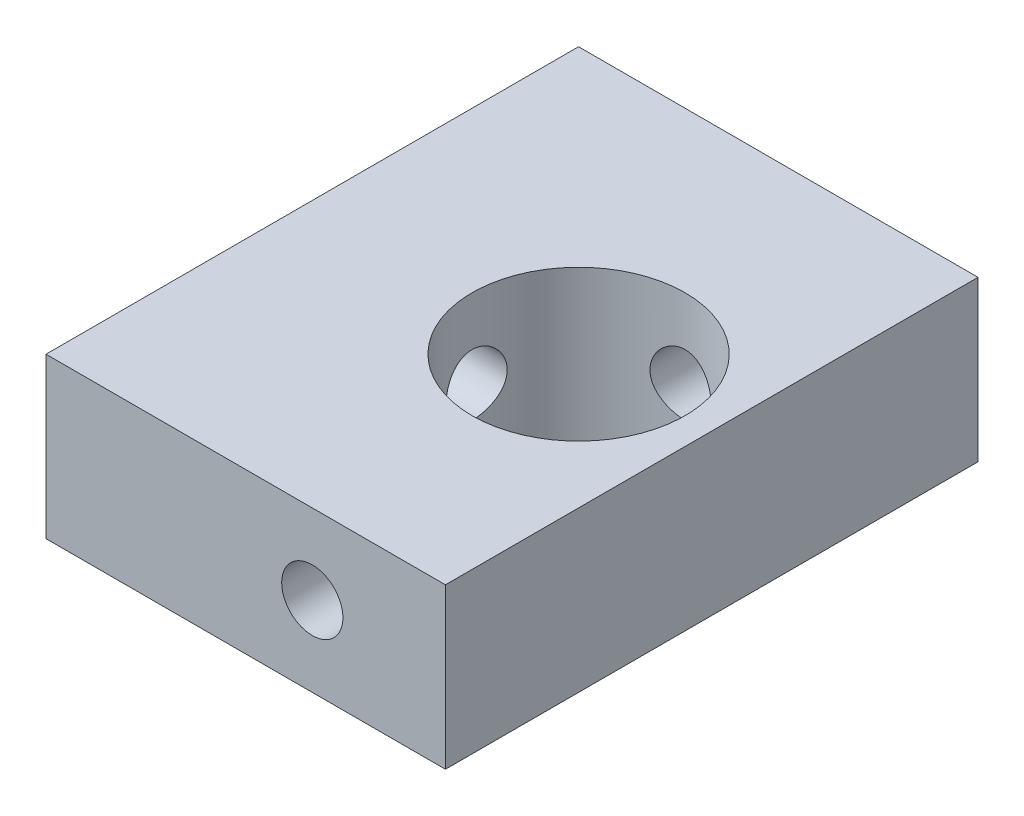
ISO-10303-21;
HEADER;
FILE_DESCRIPTION(('STEP AP214'),'2;1');
FILE_NAME('part.step','',(''),(''),'','','');
FILE_SCHEMA(('AUTOMOTIVE_DESIGN { 1 0 10303 214 1 1 1 1 }'));
ENDSEC;
DATA;
#1=APPLICATION_CONTEXT('core data for automotive mechanical design processes');
#2=APPLICATION_PROTOCOL_DEFINITION('international standard','automotive_design',2000,#1);
#3=PRODUCT_CONTEXT('',#1,'mechanical');
#4=PRODUCT('Part','Part','',(#3));
#5=PRODUCT_RELATED_PRODUCT_CATEGORY('part','',(#4));
#6=PRODUCT_DEFINITION_FORMATION('','',#4);
#7=PRODUCT_DEFINITION_CONTEXT('part definition',#1,'design');
#8=PRODUCT_DEFINITION('design','',#6,#7);
#9=PRODUCT_DEFINITION_SHAPE('','',#8);
#10=(LENGTH_UNIT() NAMED_UNIT(*) SI_UNIT(.MILLI.,.METRE.));
#11=(NAMED_UNIT(*) PLANE_ANGLE_UNIT() SI_UNIT($,.RADIAN.));
#12=(NAMED_UNIT(*) SI_UNIT($,.STERADIAN.) SOLID_ANGLE_UNIT());
#13=UNCERTAINTY_MEASURE_WITH_UNIT(LENGTH_MEASURE(1.E-05),#10,'distance_accuracy_value','');
#14=(GEOMETRIC_REPRESENTATION_CONTEXT(3) GLOBAL_UNCERTAINTY_ASSIGNED_CONTEXT((#13)) GLOBAL_UNIT_ASSIGNED_CONTEXT((#10,
#11,#12)) REPRESENTATION_CONTEXT('',''));
#15=CARTESIAN_POINT('',(0.,0.,0.));
#16=DIRECTION('',(0.,0.,1.));
#17=DIRECTION('',(1.,0.,0.));
#18=AXIS2_PLACEMENT_3D('',#15,#16,#17);
#19=CARTESIAN_POINT('',(10.,3.,20.));
#20=DIRECTION('',(0.,0.,-1.));
#21=DIRECTION('',(-1.,0.,0.));
#22=AXIS2_PLACEMENT_3D('',#19,#20,#21);
#23=CYLINDRICAL_SURFACE('',#22,1.15);
#24=CARTESIAN_POINT('',(8.85,3.,13.8311225508981));
#25=CARTESIAN_POINT('',(8.85000109713594,2.93685354763671,13.8311234096432));
#26=CARTESIAN_POINT('',(8.85521875938077,2.87369604653529,13.8327008482293));
#27=CARTESIAN_POINT('',(8.87590336907801,2.74921880863793,13.8388174631075));
#28=CARTESIAN_POINT('',(8.89137439287323,2.6878998128995,13.8433578173301));
#29=CARTESIAN_POINT('',(8.93200398573888,2.56891896779639,13.8548444617641));
#30=CARTESIAN_POINT('',(8.95714741863079,2.51125156750833,13.8617869911566));
#31=CARTESIAN_POINT('',(9.01635919152072,2.40094121549271,13.8772907666046));
#32=CARTESIAN_POINT('',(9.05042862571803,2.34829888084604,13.8858522110799));
#33=CARTESIAN_POINT('',(9.12758497596414,2.24800305821177,13.9039081457365));
#34=CARTESIAN_POINT('',(9.17088552483237,2.20051723044332,13.9134212557284));
#35=CARTESIAN_POINT('',(9.26481649766861,2.11337131483704,13.93214894899));
#36=CARTESIAN_POINT('',(9.3154477886892,2.07371215402091,13.941363496789));
#37=CARTESIAN_POINT('',(9.42378405058578,2.00262855922055,13.958665902629));
#38=CARTESIAN_POINT('',(9.48160435904936,1.97137342120741,13.9667292515258));
#39=CARTESIAN_POINT('',(9.60195084081706,1.91909370888843,13.9806054546299));
#40=CARTESIAN_POINT('',(9.66447608308574,1.89806711662292,13.9864187526967));
#41=CARTESIAN_POINT('',(9.79070500883242,1.86739145819638,13.9950081423137));
#42=CARTESIAN_POINT('',(9.85433396136122,1.85745658262848,13.9978603903831));
#43=CARTESIAN_POINT('',(9.98241516794994,1.84834439508034,14.0004737583295));
#44=CARTESIAN_POINT('',(10.0468672603199,1.84916500190013,14.0002354762282));
#45=CARTESIAN_POINT('',(10.1727662359451,1.86134497675429,13.9967492302424));
#46=CARTESIAN_POINT('',(10.2342458601377,1.87239512664959,13.9935895768992));
#47=CARTESIAN_POINT('',(10.3544381694963,1.90421756715159,13.9847217177274));
#48=CARTESIAN_POINT('',(10.4131506851542,1.92499045250551,13.9790133559934));
#49=CARTESIAN_POINT('',(10.5268981348963,1.97588861231533,13.9655639569197));
#50=CARTESIAN_POINT('',(10.5818853868973,2.00611447226775,13.9578012031085));
#51=CARTESIAN_POINT('',(10.686108784487,2.07498199129164,13.9410715508783));
#52=CARTESIAN_POINT('',(10.7353436530329,2.11362551367083,13.9321043860233));
#53=CARTESIAN_POINT('',(10.8285106967381,2.19985012239459,13.913554446745));
#54=CARTESIAN_POINT('',(10.8721924098498,2.24769991013597,13.9039611194572));
#55=CARTESIAN_POINT('',(10.9509785745041,2.35014190982722,13.8855220189199));
#56=CARTESIAN_POINT('',(10.9860823118708,2.40473468260804,13.8766763079548));
#57=CARTESIAN_POINT('',(11.0469491955457,2.51972677993943,13.8606864875837));
#58=CARTESIAN_POINT('',(11.0726336618664,2.58016991201733,13.8535568752147));
#59=CARTESIAN_POINT('',(11.1133891241829,2.7047745792295,13.841981078064));
#60=CARTESIAN_POINT('',(11.1284632535755,2.76893501052477,13.8375341011141));
#61=CARTESIAN_POINT('',(11.1471162340068,2.89678504548647,13.8319990048806));
#62=CARTESIAN_POINT('',(11.1510730711851,2.96041477483418,13.8308004903882));
#63=CARTESIAN_POINT('',(11.1484292606137,3.08742899506654,13.8315939820927));
#64=CARTESIAN_POINT('',(11.1418299491375,3.15081351597334,13.8335855844615));
#65=CARTESIAN_POINT('',(11.118596554369,3.27400892985881,13.8404272046237));
#66=CARTESIAN_POINT('',(11.1021995229819,3.33386865703835,13.8452096374164));
#67=CARTESIAN_POINT('',(11.0601077430504,3.44998546694598,13.8570255765461));
#68=CARTESIAN_POINT('',(11.0344116410675,3.50624202384511,13.8640594105474));
#69=CARTESIAN_POINT('',(10.9737148486598,3.61511001116527,13.8798045097428));
#70=CARTESIAN_POINT('',(10.9384975703062,3.66759512627495,13.8885533200723));
#71=CARTESIAN_POINT('',(10.8600196226804,3.76604914872634,13.9066590507113));
#72=CARTESIAN_POINT('',(10.8167571878005,3.81201662178159,13.9160161042134));
#73=CARTESIAN_POINT('',(10.7216509250253,3.89775091777679,13.9346719440207));
#74=CARTESIAN_POINT('',(10.6695639192415,3.93725142123724,13.9439577564339));
#75=CARTESIAN_POINT('',(10.5592834730476,4.00695383710908,13.9610997441538));
#76=CARTESIAN_POINT('',(10.501090350612,4.03715623339531,13.9689559938464));
#77=CARTESIAN_POINT('',(10.3806506157329,4.08711614590499,13.9823038526595));
#78=CARTESIAN_POINT('',(10.3184388507805,4.10695267050574,13.9878132876844));
#79=CARTESIAN_POINT('',(10.1913798256697,4.13583241025023,13.9959254931484));
#80=CARTESIAN_POINT('',(10.1265332572855,4.14487843977111,13.9985290214948));
#81=CARTESIAN_POINT('',(9.99851650441062,4.15172074840701,14.0004939021936));
#82=CARTESIAN_POINT('',(9.93536849385019,4.14990485811465,13.999967031704));
#83=CARTESIAN_POINT('',(9.81031469284554,4.13599167465084,13.995989631422));
#84=CARTESIAN_POINT('',(9.74840884176098,4.12389488463335,13.9925392447084));
#85=CARTESIAN_POINT('',(9.62814263341813,4.08999586262566,13.9831307693267));
#86=CARTESIAN_POINT('',(9.56975501271397,4.0682834691471,13.9771959204306));
#87=CARTESIAN_POINT('',(9.45741937378848,4.0158495223448,13.9634344278209));
#88=CARTESIAN_POINT('',(9.40347205017424,3.98512656289235,13.9556074888739));
#89=CARTESIAN_POINT('',(9.29978977331117,3.9144716965877,13.9385975168749));
#90=CARTESIAN_POINT('',(9.25022991228369,3.87429100539303,13.9293808251979));
#91=CARTESIAN_POINT('',(9.15842587096337,3.78631839616156,13.9107482289939));
#92=CARTESIAN_POINT('',(9.11618372897389,3.7385243645712,13.9013322697791));
#93=CARTESIAN_POINT('',(9.03908743865413,3.63514895353306,13.8830737328542));
#94=CARTESIAN_POINT('',(9.00446060677457,3.57939375471937,13.8742531706148));
#95=CARTESIAN_POINT('',(8.94511649390382,3.46260717564617,13.8585190322725));
#96=CARTESIAN_POINT('',(8.92039376066198,3.40157872089631,13.8516044075984));
#97=CARTESIAN_POINT('',(8.88418491195494,3.284130424163,13.8412580119303));
#98=CARTESIAN_POINT('',(8.87139878025116,3.22813801740635,13.8374910523626));
#99=CARTESIAN_POINT('',(8.8543065153319,3.11476663088778,13.8324231321664));
#100=CARTESIAN_POINT('',(8.84999900291622,3.05738787817743,13.8311217704654));
#101=CARTESIAN_POINT('',(8.85,3.,13.8311225508981));
#102=B_SPLINE_CURVE_WITH_KNOTS('',3,(#24,#25,#26,#27,#28,#29,#30,#31,#32,#33,#34,#35,#36,#37,
#38,#39,#40,#41,#42,#43,#44,#45,#46,#47,#48,#49,#50,#51,#52,#53,#54,#55,#56,#57,#58,#59,#60,#61,
#62,#63,#64,#65,#66,#67,#68,#69,#70,#71,#72,#73,#74,#75,#76,#77,#78,#79,#80,#81,#82,#83,#84,#85,
#86,#87,#88,#89,#90,#91,#92,#93,#94,#95,#96,#97,#98,#99,#100,#101),.UNSPECIFIED.,.T.,.F.,(4,2,2,
2,2,2,2,2,2,2,2,2,2,2,2,2,2,2,2,2,2,2,2,2,2,2,2,2,2,2,2,2,2,2,2,2,2,2,4),(0.,0.189227930907146,
0.378531136737258,0.567539302607267,0.7565706490078,0.95057452796,1.14460137173343,
1.34228521426901,1.53993004050829,1.73235516813842,1.9247430618032,2.11149893393056,
2.29826623155154,2.48709264626916,2.67596090156999,2.87153758994763,3.06713055589602,
3.26432199425326,3.46145517446465,3.65179968398441,3.84212010022938,4.02801232563787,
4.21393161772203,4.40449966366975,4.59510958156286,4.79224838850887,4.98937693458781,
5.18498021232715,5.38053246165302,5.56914510017873,5.75774850841006,5.94462579753225,
6.13153226500683,6.32405015408942,6.51662158186276,6.71433352890712,6.91193648457659,
7.08393595483978,7.25590744397728),.UNSPECIFIED.);
#103=CARTESIAN_POINT('',(8.85,3.,13.8311225508981));
#104=VERTEX_POINT('',#103);
#105=EDGE_CURVE('E36',#104,#104,#102,.T.);
#106=ORIENTED_EDGE('',*,*,#105,.F.);
#107=EDGE_LOOP('',(#106));
#108=FACE_BOUND('',#107,.T.);
#109=CARTESIAN_POINT('',(10.,3.,20.));
#110=DIRECTION('',(0.,0.,1.));
#111=DIRECTION('',(1.,0.,0.));
#112=AXIS2_PLACEMENT_3D('',#109,#110,#111);
#113=CIRCLE('',#112,1.15);
#114=CARTESIAN_POINT('',(11.15,3.,20.));
#115=VERTEX_POINT('',#114);
#116=EDGE_CURVE('E107',#115,#115,#113,.T.);
#117=ORIENTED_EDGE('',*,*,#116,.T.);
#118=EDGE_LOOP('',(#117));
#119=FACE_BOUND('',#118,.T.);
#120=ADVANCED_FACE('F32',(#108,#119),#23,.F.);
#121=CARTESIAN_POINT('',(0.,0.,20.));
#122=DIRECTION('',(0.,0.,-1.));
#123=DIRECTION('',(-1.,0.,0.));
#124=AXIS2_PLACEMENT_3D('',#121,#122,#123);
#125=PLANE('',#124);
#126=DIRECTION('',(0.,-1.,0.));
#127=VECTOR('',#126,1.);
#128=CARTESIAN_POINT('',(0.,0.,20.));
#129=LINE('',#128,#127);
#130=CARTESIAN_POINT('',(0.,6.,20.));
#131=VERTEX_POINT('',#130);
#132=CARTESIAN_POINT('',(0.,0.,20.));
#133=VERTEX_POINT('',#132);
#134=EDGE_CURVE('E91',#131,#133,#129,.T.);
#135=ORIENTED_EDGE('',*,*,#134,.T.);
#136=DIRECTION('',(1.,0.,0.));
#137=VECTOR('',#136,1.);
#138=CARTESIAN_POINT('',(0.,0.,20.));
#139=LINE('',#138,#137);
#140=CARTESIAN_POINT('',(15.,0.,20.));
#141=VERTEX_POINT('',#140);
#142=EDGE_CURVE('E85',#133,#141,#139,.T.);
#143=ORIENTED_EDGE('',*,*,#142,.T.);
#144=DIRECTION('',(0.,1.,0.));
#145=VECTOR('',#144,1.);
#146=CARTESIAN_POINT('',(15.,0.,20.));
#147=LINE('',#146,#145);
#148=CARTESIAN_POINT('',(15.,6.,20.));
#149=VERTEX_POINT('',#148);
#150=EDGE_CURVE('E89',#141,#149,#147,.T.);
#151=ORIENTED_EDGE('',*,*,#150,.T.);
#152=DIRECTION('',(-1.,0.,0.));
#153=VECTOR('',#152,1.);
#154=CARTESIAN_POINT('',(0.,6.,20.));
#155=LINE('',#154,#153);
#156=EDGE_CURVE('E55',#149,#131,#155,.T.);
#157=ORIENTED_EDGE('',*,*,#156,.T.);
#158=EDGE_LOOP('',(#135,#143,#151,#157));
#159=FACE_BOUND('',#158,.T.);
#160=ORIENTED_EDGE('',*,*,#116,.F.);
#161=EDGE_LOOP('',(#160));
#162=FACE_BOUND('',#161,.T.);
#163=ADVANCED_FACE('F86',(#159,#162),#125,.F.);
#164=CARTESIAN_POINT('',(0.,0.,0.));
#165=DIRECTION('',(0.,0.,-1.));
#166=DIRECTION('',(-1.,0.,0.));
#167=AXIS2_PLACEMENT_3D('',#164,#165,#166);
#168=PLANE('',#167);
#169=DIRECTION('',(0.,-1.,0.));
#170=VECTOR('',#169,1.);
#171=CARTESIAN_POINT('',(0.,0.,0.));
#172=LINE('',#171,#170);
#173=CARTESIAN_POINT('',(0.,6.,0.));
#174=VERTEX_POINT('',#173);
#175=CARTESIAN_POINT('',(0.,0.,0.));
#176=VERTEX_POINT('',#175);
#177=EDGE_CURVE('E104',#174,#176,#172,.T.);
#178=ORIENTED_EDGE('',*,*,#177,.F.);
#179=DIRECTION('',(-1.,0.,0.));
#180=VECTOR('',#179,1.);
#181=CARTESIAN_POINT('',(0.,6.,0.));
#182=LINE('',#181,#180);
#183=CARTESIAN_POINT('',(15.,6.,0.));
#184=VERTEX_POINT('',#183);
#185=EDGE_CURVE('E78',#184,#174,#182,.T.);
#186=ORIENTED_EDGE('',*,*,#185,.F.);
#187=DIRECTION('',(0.,1.,0.));
#188=VECTOR('',#187,1.);
#189=CARTESIAN_POINT('',(15.,0.,0.));
#190=LINE('',#189,#188);
#191=CARTESIAN_POINT('',(15.,0.,0.));
#192=VERTEX_POINT('',#191);
#193=EDGE_CURVE('E72',#192,#184,#190,.T.);
#194=ORIENTED_EDGE('',*,*,#193,.F.);
#195=DIRECTION('',(1.,0.,0.));
#196=VECTOR('',#195,1.);
#197=CARTESIAN_POINT('',(0.,0.,0.));
#198=LINE('',#197,#196);
#199=EDGE_CURVE('E95',#176,#192,#198,.T.);
#200=ORIENTED_EDGE('',*,*,#199,.F.);
#201=EDGE_LOOP('',(#178,#186,#194,#200));
#202=FACE_BOUND('',#201,.T.);
#203=CARTESIAN_POINT('',(10.,3.,0.));
#204=DIRECTION('',(0.,0.,1.));
#205=DIRECTION('',(1.,0.,0.));
#206=AXIS2_PLACEMENT_3D('',#203,#204,#205);
#207=CIRCLE('',#206,1.15);
#208=CARTESIAN_POINT('',(11.15,3.,0.));
#209=VERTEX_POINT('',#208);
#210=EDGE_CURVE('E146',#209,#209,#207,.T.);
#211=ORIENTED_EDGE('',*,*,#210,.T.);
#212=EDGE_LOOP('',(#211));
#213=FACE_BOUND('',#212,.T.);
#214=ADVANCED_FACE('F152',(#202,#213),#168,.T.);
#215=CARTESIAN_POINT('',(0.,0.,20.));
#216=DIRECTION('',(1.,0.,0.));
#217=DIRECTION('',(0.,0.,-1.));
#218=AXIS2_PLACEMENT_3D('',#215,#216,#217);
#219=PLANE('',#218);
#220=CARTESIAN_POINT('',(0.,3.,10.));
#221=DIRECTION('',(-1.,0.,0.));
#222=DIRECTION('',(0.,0.,1.));
#223=AXIS2_PLACEMENT_3D('',#220,#221,#222);
#224=CIRCLE('',#223,1.15);
#225=CARTESIAN_POINT('',(0.,3.,11.15));
#226=VERTEX_POINT('',#225);
#227=EDGE_CURVE('E138',#226,#226,#224,.T.);
#228=ORIENTED_EDGE('',*,*,#227,.F.);
#229=EDGE_LOOP('',(#228));
#230=FACE_BOUND('',#229,.T.);
#231=ORIENTED_EDGE('',*,*,#177,.T.);
#232=DIRECTION('',(0.,0.,-1.));
#233=VECTOR('',#232,1.);
#234=CARTESIAN_POINT('',(0.,0.,20.));
#235=LINE('',#234,#233);
#236=EDGE_CURVE('E11',#133,#176,#235,.T.);
#237=ORIENTED_EDGE('',*,*,#236,.F.);
#238=ORIENTED_EDGE('',*,*,#134,.F.);
#239=DIRECTION('',(0.,0.,-1.));
#240=VECTOR('',#239,1.);
#241=CARTESIAN_POINT('',(0.,6.,20.));
#242=LINE('',#241,#240);
#243=EDGE_CURVE('E100',#131,#174,#242,.T.);
#244=ORIENTED_EDGE('',*,*,#243,.T.);
#245=EDGE_LOOP('',(#231,#237,#238,#244));
#246=FACE_BOUND('',#245,.T.);
#247=ADVANCED_FACE('F34',(#230,#246),#219,.F.);
#248=CARTESIAN_POINT('',(0.,0.,20.));
#249=DIRECTION('',(0.,1.,0.));
#250=DIRECTION('',(0.,0.,1.));
#251=AXIS2_PLACEMENT_3D('',#248,#249,#250);
#252=PLANE('',#251);
#253=CARTESIAN_POINT('',(10.,0.,10.));
#254=DIRECTION('',(0.,-1.,0.));
#255=DIRECTION('',(0.,0.,-1.));
#256=AXIS2_PLACEMENT_3D('',#253,#254,#255);
#257=CIRCLE('',#256,4.);
#258=CARTESIAN_POINT('',(10.,0.,6.));
#259=VERTEX_POINT('',#258);
#260=EDGE_CURVE('E116',#259,#259,#257,.T.);
#261=ORIENTED_EDGE('',*,*,#260,.F.);
#262=EDGE_LOOP('',(#261));
#263=FACE_BOUND('',#262,.T.);
#264=ORIENTED_EDGE('',*,*,#199,.T.);
#265=DIRECTION('',(0.,0.,-1.));
#266=VECTOR('',#265,1.);
#267=CARTESIAN_POINT('',(15.,0.,20.));
#268=LINE('',#267,#266);
#269=EDGE_CURVE('E46',#141,#192,#268,.T.);
#270=ORIENTED_EDGE('',*,*,#269,.F.);
#271=ORIENTED_EDGE('',*,*,#142,.F.);
#272=ORIENTED_EDGE('',*,*,#236,.T.);
#273=EDGE_LOOP('',(#264,#270,#271,#272));
#274=FACE_BOUND('',#273,.T.);
#275=ADVANCED_FACE('F94',(#263,#274),#252,.F.);
#276=CARTESIAN_POINT('',(15.,0.,20.));
#277=DIRECTION('',(-1.,0.,0.));
#278=DIRECTION('',(0.,0.,1.));
#279=AXIS2_PLACEMENT_3D('',#276,#277,#278);
#280=PLANE('',#279);
#281=ORIENTED_EDGE('',*,*,#193,.T.);
#282=DIRECTION('',(0.,0.,-1.));
#283=VECTOR('',#282,1.);
#284=CARTESIAN_POINT('',(15.,6.,20.));
#285=LINE('',#284,#283);
#286=EDGE_CURVE('E96',#149,#184,#285,.T.);
#287=ORIENTED_EDGE('',*,*,#286,.F.);
#288=ORIENTED_EDGE('',*,*,#150,.F.);
#289=ORIENTED_EDGE('',*,*,#269,.T.);
#290=EDGE_LOOP('',(#281,#287,#288,#289));
#291=FACE_BOUND('',#290,.T.);
#292=ADVANCED_FACE('F98',(#291),#280,.F.);
#293=CARTESIAN_POINT('',(0.,6.,20.));
#294=DIRECTION('',(0.,-1.,0.));
#295=DIRECTION('',(0.,0.,-1.));
#296=AXIS2_PLACEMENT_3D('',#293,#294,#295);
#297=PLANE('',#296);
#298=CARTESIAN_POINT('',(10.,6.,10.));
#299=DIRECTION('',(0.,-1.,0.));
#300=DIRECTION('',(0.,0.,-1.));
#301=AXIS2_PLACEMENT_3D('',#298,#299,#300);
#302=CIRCLE('',#301,4.);
#303=CARTESIAN_POINT('',(10.,6.,6.));
#304=VERTEX_POINT('',#303);
#305=EDGE_CURVE('E143',#304,#304,#302,.T.);
#306=ORIENTED_EDGE('',*,*,#305,.T.);
#307=EDGE_LOOP('',(#306));
#308=FACE_BOUND('',#307,.T.);
#309=ORIENTED_EDGE('',*,*,#185,.T.);
#310=ORIENTED_EDGE('',*,*,#243,.F.);
#311=ORIENTED_EDGE('',*,*,#156,.F.);
#312=ORIENTED_EDGE('',*,*,#286,.T.);
#313=EDGE_LOOP('',(#309,#310,#311,#312));
#314=FACE_BOUND('',#313,.T.);
#315=ADVANCED_FACE('F155',(#308,#314),#297,.F.);
#316=CARTESIAN_POINT('',(8.85,3.,6.16887744910189));
#317=CARTESIAN_POINT('',(8.85000109713594,3.06314645236329,6.16887659035683));
#318=CARTESIAN_POINT('',(8.85521875938077,3.12630395346471,6.16729915177071));
#319=CARTESIAN_POINT('',(8.87590336907801,3.25078119136207,6.16118253689246));
#320=CARTESIAN_POINT('',(8.89137439287323,3.3121001871005,6.15664218266988));
#321=CARTESIAN_POINT('',(8.93200398573888,3.43108103220361,6.14515553823589));
#322=CARTESIAN_POINT('',(8.95714741863079,3.48874843249167,6.13821300884341));
#323=CARTESIAN_POINT('',(9.01635919152072,3.59905878450729,6.12270923339544));
#324=CARTESIAN_POINT('',(9.05042862571803,3.65170111915396,6.11414778892007));
#325=CARTESIAN_POINT('',(9.12758497596414,3.75199694178823,6.09609185426352));
#326=CARTESIAN_POINT('',(9.17088552483237,3.79948276955668,6.08657874427164));
#327=CARTESIAN_POINT('',(9.26481649766861,3.88662868516296,6.06785105101));
#328=CARTESIAN_POINT('',(9.3154477886892,3.92628784597909,6.05863650321105));
#329=CARTESIAN_POINT('',(9.42378405058578,3.99737144077945,6.04133409737104));
#330=CARTESIAN_POINT('',(9.48160435904936,4.02862657879259,6.03327074847417));
#331=CARTESIAN_POINT('',(9.60195084081707,4.08090629111157,6.01939454537012));
#332=CARTESIAN_POINT('',(9.66447608308574,4.10193288337708,6.01358124730332));
#333=CARTESIAN_POINT('',(9.79070500883242,4.13260854180362,6.00499185768634));
#334=CARTESIAN_POINT('',(9.85433396136122,4.14254341737152,6.00213960961691));
#335=CARTESIAN_POINT('',(9.98241516794994,4.15165560491966,5.9995262416705));
#336=CARTESIAN_POINT('',(10.0468672603199,4.15083499809988,5.99976452377176));
#337=CARTESIAN_POINT('',(10.1727662359451,4.13865502324571,6.00325076975757));
#338=CARTESIAN_POINT('',(10.2342458601377,4.12760487335041,6.00641042310082));
#339=CARTESIAN_POINT('',(10.3544381694963,4.09578243284841,6.01527828227262));
#340=CARTESIAN_POINT('',(10.4131506851542,4.07500954749449,6.02098664400664));
#341=CARTESIAN_POINT('',(10.5268981348963,4.02411138768467,6.03443604308026));
#342=CARTESIAN_POINT('',(10.5818853868973,3.99388552773225,6.04219879689149));
#343=CARTESIAN_POINT('',(10.686108784487,3.92501800870836,6.05892844912174));
#344=CARTESIAN_POINT('',(10.7353436530329,3.88637448632917,6.06789561397669));
#345=CARTESIAN_POINT('',(10.8285106967381,3.80014987760541,6.08644555325504));
#346=CARTESIAN_POINT('',(10.8721924098498,3.75230008986403,6.0960388805428));
#347=CARTESIAN_POINT('',(10.9509785745041,3.64985809017278,6.11447798108007));
#348=CARTESIAN_POINT('',(10.9860823118708,3.59526531739196,6.12332369204524));
#349=CARTESIAN_POINT('',(11.0469491955457,3.48027322006057,6.13931351241626));
#350=CARTESIAN_POINT('',(11.0726336618664,3.41983008798267,6.14644312478529));
#351=CARTESIAN_POINT('',(11.1133891241829,3.2952254207705,6.15801892193597));
#352=CARTESIAN_POINT('',(11.1284632535755,3.23106498947523,6.1624658988859));
#353=CARTESIAN_POINT('',(11.1471162340068,3.10321495451353,6.16800099511944));
#354=CARTESIAN_POINT('',(11.1510730711851,3.03958522516582,6.16919950961178));
#355=CARTESIAN_POINT('',(11.1484292606137,2.91257100493346,6.16840601790732));
#356=CARTESIAN_POINT('',(11.1418299491375,2.84918648402666,6.1664144155385));
#357=CARTESIAN_POINT('',(11.118596554369,2.72599107014119,6.15957279537628));
#358=CARTESIAN_POINT('',(11.1021995229819,2.66613134296165,6.15479036258361));
#359=CARTESIAN_POINT('',(11.0601077430503,2.55001453305402,6.14297442345391));
#360=CARTESIAN_POINT('',(11.0344116410675,2.49375797615489,6.13594058945265));
#361=CARTESIAN_POINT('',(10.9737148486598,2.38488998883473,6.12019549025716));
#362=CARTESIAN_POINT('',(10.9384975703062,2.33240487372505,6.11144667992769));
#363=CARTESIAN_POINT('',(10.8600196226804,2.23395085127366,6.09334094928874));
#364=CARTESIAN_POINT('',(10.8167571878005,2.18798337821841,6.08398389578664));
#365=CARTESIAN_POINT('',(10.7216509250253,2.10224908222321,6.06532805597935));
#366=CARTESIAN_POINT('',(10.6695639192415,2.06274857876276,6.05604224356613));
#367=CARTESIAN_POINT('',(10.5592834730476,1.99304616289092,6.03890025584623));
#368=CARTESIAN_POINT('',(10.501090350612,1.96284376660469,6.03104400615359));
#369=CARTESIAN_POINT('',(10.3806506157329,1.91288385409501,6.0176961473405));
#370=CARTESIAN_POINT('',(10.3184388507805,1.89304732949427,6.01218671231556));
#371=CARTESIAN_POINT('',(10.1913798256697,1.86416758974977,6.00407450685155));
#372=CARTESIAN_POINT('',(10.1265332572855,1.85512156022889,6.00147097850524));
#373=CARTESIAN_POINT('',(9.99851650441062,1.84827925159299,5.99950609780644));
#374=CARTESIAN_POINT('',(9.93536849385019,1.85009514188535,6.00003296829596));
#375=CARTESIAN_POINT('',(9.81031469284554,1.86400832534916,6.00401036857797));
#376=CARTESIAN_POINT('',(9.74840884176098,1.87610511536665,6.00746075529163));
#377=CARTESIAN_POINT('',(9.62814263341813,1.91000413737434,6.01686923067332));
#378=CARTESIAN_POINT('',(9.56975501271397,1.9317165308529,6.02280407956938));
#379=CARTESIAN_POINT('',(9.45741937378848,1.9841504776552,6.03656557217908));
#380=CARTESIAN_POINT('',(9.40347205017424,2.01487343710765,6.04439251112612));
#381=CARTESIAN_POINT('',(9.29978977331117,2.0855283034123,6.06140248312509));
#382=CARTESIAN_POINT('',(9.25022991228369,2.12570899460697,6.07061917480209));
#383=CARTESIAN_POINT('',(9.15842587096337,2.21368160383844,6.08925177100611));
#384=CARTESIAN_POINT('',(9.11618372897389,2.2614756354288,6.09866773022087));
#385=CARTESIAN_POINT('',(9.03908743865413,2.36485104646694,6.1169262671458));
#386=CARTESIAN_POINT('',(9.00446060677457,2.42060624528063,6.12574682938524));
#387=CARTESIAN_POINT('',(8.94511649390382,2.53739282435383,6.14148096772746));
#388=CARTESIAN_POINT('',(8.92039376066198,2.59842127910369,6.14839559240155));
#389=CARTESIAN_POINT('',(8.88418491195494,2.715869575837,6.15874198806971));
#390=CARTESIAN_POINT('',(8.87139878025116,2.77186198259365,6.16250894763743));
#391=CARTESIAN_POINT('',(8.8543065153319,2.88523336911222,6.16757686783356));
#392=CARTESIAN_POINT('',(8.84999900291622,2.94261212182257,6.16887822953461));
#393=CARTESIAN_POINT('',(8.85,3.,6.16887744910189));
#394=B_SPLINE_CURVE_WITH_KNOTS('',3,(#316,#317,#318,#319,#320,#321,#322,#323,#324,#325,#326,
#327,#328,#329,#330,#331,#332,#333,#334,#335,#336,#337,#338,#339,#340,#341,#342,#343,#344,#345,
#346,#347,#348,#349,#350,#351,#352,#353,#354,#355,#356,#357,#358,#359,#360,#361,#362,#363,#364,
#365,#366,#367,#368,#369,#370,#371,#372,#373,#374,#375,#376,#377,#378,#379,#380,#381,#382,#383,
#384,#385,#386,#387,#388,#389,#390,#391,#392,#393),.UNSPECIFIED.,.T.,.F.,(4,2,2,2,2,2,2,2,2,2,2,
2,2,2,2,2,2,2,2,2,2,2,2,2,2,2,2,2,2,2,2,2,2,2,2,2,2,2,4),(0.,0.189227930907146,
0.378531136737258,0.567539302607266,0.7565706490078,0.950574527960001,1.14460137173343,
1.34228521426902,1.53993004050829,1.73235516813842,1.9247430618032,2.11149893393056,
2.29826623155154,2.48709264626916,2.67596090156999,2.87153758994763,3.06713055589602,
3.26432199425326,3.46145517446465,3.65179968398441,3.84212010022938,4.02801232563787,
4.21393161772203,4.40449966366975,4.59510958156286,4.79224838850887,4.98937693458781,
5.18498021232715,5.38053246165302,5.56914510017873,5.75774850841006,5.94462579753225,
6.13153226500683,6.32405015408942,6.51662158186276,6.71433352890713,6.91193648457659,
7.08393595483978,7.25590744397728),.UNSPECIFIED.);
#395=CARTESIAN_POINT('',(8.85,3.,6.16887744910189));
#396=VERTEX_POINT('',#395);
#397=EDGE_CURVE('E112',#396,#396,#394,.T.);
#398=ORIENTED_EDGE('',*,*,#397,.F.);
#399=EDGE_LOOP('',(#398));
#400=FACE_BOUND('',#399,.T.);
#401=ORIENTED_EDGE('',*,*,#210,.F.);
#402=EDGE_LOOP('',(#401));
#403=FACE_BOUND('',#402,.T.);
#404=ADVANCED_FACE('F117',(#400,#403),#23,.F.);
#405=CARTESIAN_POINT('',(10.,20.,10.));
#406=DIRECTION('',(0.,-1.,0.));
#407=DIRECTION('',(0.,0.,-1.));
#408=AXIS2_PLACEMENT_3D('',#405,#406,#407);
#409=CYLINDRICAL_SURFACE('',#408,4.);
#410=CARTESIAN_POINT('',(6.1688774491019,3.,11.15));
#411=CARTESIAN_POINT('',(6.16887659035683,2.93685354763671,11.1499989028641));
#412=CARTESIAN_POINT('',(6.16729915177071,2.87369604653529,11.1447812406192));
#413=CARTESIAN_POINT('',(6.16118253689246,2.74921880863793,11.124096630922));
#414=CARTESIAN_POINT('',(6.15664218266988,2.6878998128995,11.1086256071268));
#415=CARTESIAN_POINT('',(6.14515553823589,2.56891896779639,11.0679960142611));
#416=CARTESIAN_POINT('',(6.13821300884341,2.51125156750833,11.0428525813692));
#417=CARTESIAN_POINT('',(6.12270923339544,2.40094121549271,10.9836408084793));
#418=CARTESIAN_POINT('',(6.11414778892007,2.34829888084604,10.949571374282));
#419=CARTESIAN_POINT('',(6.09609185426352,2.24800305821177,10.8724150240359));
#420=CARTESIAN_POINT('',(6.08657874427164,2.20051723044332,10.8291144751676));
#421=CARTESIAN_POINT('',(6.06785105101,2.11337131483704,10.7351835023314));
#422=CARTESIAN_POINT('',(6.05863650321105,2.07371215402091,10.6845522113108));
#423=CARTESIAN_POINT('',(6.04133409737104,2.00262855922055,10.5762159494142));
#424=CARTESIAN_POINT('',(6.03327074847417,1.97137342120741,10.5183956409506));
#425=CARTESIAN_POINT('',(6.01939454537012,1.91909370888843,10.3980491591829));
#426=CARTESIAN_POINT('',(6.01358124730332,1.89806711662292,10.3355239169143));
#427=CARTESIAN_POINT('',(6.00499185768634,1.86739145819638,10.2092949911676));
#428=CARTESIAN_POINT('',(6.00213960961691,1.85745658262848,10.1456660386388));
#429=CARTESIAN_POINT('',(5.9995262416705,1.84834439508034,10.0175848320501));
#430=CARTESIAN_POINT('',(5.99976452377176,1.84916500190013,9.95313273968009));
#431=CARTESIAN_POINT('',(6.00325076975757,1.86134497675429,9.82723376405494));
#432=CARTESIAN_POINT('',(6.00641042310082,1.87239512664959,9.76575413986226));
#433=CARTESIAN_POINT('',(6.01527828227262,1.90421756715159,9.64556183050367));
#434=CARTESIAN_POINT('',(6.02098664400663,1.92499045250551,9.58684931484578));
#435=CARTESIAN_POINT('',(6.03443604308026,1.97588861231533,9.47310186510368));
#436=CARTESIAN_POINT('',(6.04219879689149,2.00611447226775,9.4181146131027));
#437=CARTESIAN_POINT('',(6.05892844912174,2.07498199129164,9.31389121551296));
#438=CARTESIAN_POINT('',(6.06789561397669,2.11362551367083,9.26465634696714));
#439=CARTESIAN_POINT('',(6.08644555325504,2.19985012239459,9.17148930326191));
#440=CARTESIAN_POINT('',(6.09603888054281,2.24769991013597,9.12780759015016));
#441=CARTESIAN_POINT('',(6.11447798108007,2.35014190982722,9.04902142549585));
#442=CARTESIAN_POINT('',(6.12332369204525,2.40473468260804,9.01391768812922));
#443=CARTESIAN_POINT('',(6.13931351241626,2.51972677993943,8.95305080445431));
#444=CARTESIAN_POINT('',(6.14644312478529,2.58016991201733,8.92736633813361));
#445=CARTESIAN_POINT('',(6.15801892193597,2.7047745792295,8.88661087581711));
#446=CARTESIAN_POINT('',(6.1624658988859,2.76893501052477,8.87153674642449));
#447=CARTESIAN_POINT('',(6.16800099511944,2.89678504548647,8.85288376599325));
#448=CARTESIAN_POINT('',(6.16919950961178,2.96041477483418,8.84892692881492));
#449=CARTESIAN_POINT('',(6.16840601790732,3.08742899506654,8.85157073938631));
#450=CARTESIAN_POINT('',(6.1664144155385,3.15081351597334,8.85817005086255));
#451=CARTESIAN_POINT('',(6.15957279537628,3.27400892985881,8.88140344563104));
#452=CARTESIAN_POINT('',(6.15479036258362,3.33386865703835,8.8978004770181));
#453=CARTESIAN_POINT('',(6.14297442345391,3.44998546694598,8.93989225694965));
#454=CARTESIAN_POINT('',(6.13594058945265,3.50624202384511,8.96558835893252));
#455=CARTESIAN_POINT('',(6.12019549025716,3.61511001116527,9.0262851513402));
#456=CARTESIAN_POINT('',(6.11144667992769,3.66759512627495,9.06150242969382));
#457=CARTESIAN_POINT('',(6.09334094928874,3.76604914872634,9.13998037731961));
#458=CARTESIAN_POINT('',(6.08398389578664,3.81201662178159,9.18324281219954));
#459=CARTESIAN_POINT('',(6.06532805597935,3.89775091777679,9.27834907497474));
#460=CARTESIAN_POINT('',(6.05604224356613,3.93725142123724,9.33043608075846));
#461=CARTESIAN_POINT('',(6.03890025584623,4.00695383710908,9.44071652695239));
#462=CARTESIAN_POINT('',(6.03104400615359,4.03715623339531,9.49890964938801));
#463=CARTESIAN_POINT('',(6.0176961473405,4.08711614590499,9.6193493842671));
#464=CARTESIAN_POINT('',(6.01218671231556,4.10695267050574,9.68156114921948));
#465=CARTESIAN_POINT('',(6.00407450685155,4.13583241025023,9.8086201743303));
#466=CARTESIAN_POINT('',(6.00147097850524,4.14487843977111,9.87346674271447));
#467=CARTESIAN_POINT('',(5.99950609780644,4.15172074840701,10.0014834955894));
#468=CARTESIAN_POINT('',(6.00003296829596,4.14990485811465,10.0646315061498));
#469=CARTESIAN_POINT('',(6.00401036857797,4.13599167465084,10.1896853071545));
#470=CARTESIAN_POINT('',(6.00746075529163,4.12389488463335,10.251591158239));
#471=CARTESIAN_POINT('',(6.01686923067332,4.08999586262566,10.3718573665819));
#472=CARTESIAN_POINT('',(6.02280407956938,4.0682834691471,10.430244987286));
#473=CARTESIAN_POINT('',(6.03656557217908,4.0158495223448,10.5425806262115));
#474=CARTESIAN_POINT('',(6.04439251112612,3.98512656289235,10.5965279498258));
#475=CARTESIAN_POINT('',(6.06140248312509,3.9144716965877,10.7002102266888));
#476=CARTESIAN_POINT('',(6.07061917480209,3.87429100539303,10.7497700877163));
#477=CARTESIAN_POINT('',(6.08925177100611,3.78631839616156,10.8415741290366));
#478=CARTESIAN_POINT('',(6.09866773022087,3.73852436457119,10.8838162710261));
#479=CARTESIAN_POINT('',(6.1169262671458,3.63514895353306,10.9609125613459));
#480=CARTESIAN_POINT('',(6.12574682938524,3.57939375471937,10.9955393932254));
#481=CARTESIAN_POINT('',(6.14148096772746,3.46260717564617,11.0548835060962));
#482=CARTESIAN_POINT('',(6.14839559240155,3.40157872089631,11.079606239338));
#483=CARTESIAN_POINT('',(6.15874198806971,3.284130424163,11.1158150880451));
#484=CARTESIAN_POINT('',(6.16250894763742,3.22813801740635,11.1286012197488));
#485=CARTESIAN_POINT('',(6.16757686783356,3.11476663088778,11.1456934846681));
#486=CARTESIAN_POINT('',(6.16887822953461,3.05738787817743,11.1500009970838));
#487=CARTESIAN_POINT('',(6.1688774491019,3.,11.15));
#488=B_SPLINE_CURVE_WITH_KNOTS('',3,(#410,#411,#412,#413,#414,#415,#416,#417,#418,#419,#420,
#421,#422,#423,#424,#425,#426,#427,#428,#429,#430,#431,#432,#433,#434,#435,#436,#437,#438,#439,
#440,#441,#442,#443,#444,#445,#446,#447,#448,#449,#450,#451,#452,#453,#454,#455,#456,#457,#458,
#459,#460,#461,#462,#463,#464,#465,#466,#467,#468,#469,#470,#471,#472,#473,#474,#475,#476,#477,
#478,#479,#480,#481,#482,#483,#484,#485,#486,#487),.UNSPECIFIED.,.T.,.F.,(4,2,2,2,2,2,2,2,2,2,2,
2,2,2,2,2,2,2,2,2,2,2,2,2,2,2,2,2,2,2,2,2,2,2,2,2,2,2,4),(0.,0.189227930907146,
0.378531136737257,0.567539302607266,0.7565706490078,0.950574527960001,1.14460137173343,
1.34228521426902,1.53993004050829,1.73235516813842,1.9247430618032,2.11149893393056,
2.29826623155154,2.48709264626915,2.67596090156998,2.87153758994763,3.06713055589602,
3.26432199425326,3.46145517446465,3.65179968398441,3.84212010022938,4.02801232563786,
4.21393161772203,4.40449966366975,4.59510958156286,4.79224838850887,4.98937693458781,
5.18498021232715,5.38053246165302,5.56914510017873,5.75774850841006,5.94462579753225,
6.13153226500683,6.32405015408942,6.51662158186276,6.71433352890712,6.91193648457659,
7.08393595483977,7.25590744397728),.UNSPECIFIED.);
#489=CARTESIAN_POINT('',(6.1688774491019,3.,11.15));
#490=VERTEX_POINT('',#489);
#491=EDGE_CURVE('E133',#490,#490,#488,.T.);
#492=ORIENTED_EDGE('',*,*,#491,.F.);
#493=EDGE_LOOP('',(#492));
#494=FACE_BOUND('',#493,.T.);
#495=ORIENTED_EDGE('',*,*,#260,.T.);
#496=EDGE_LOOP('',(#495));
#497=FACE_BOUND('',#496,.T.);
#498=ORIENTED_EDGE('',*,*,#397,.T.);
#499=EDGE_LOOP('',(#498));
#500=FACE_BOUND('',#499,.T.);
#501=ORIENTED_EDGE('',*,*,#105,.T.);
#502=EDGE_LOOP('',(#501));
#503=FACE_BOUND('',#502,.T.);
#504=ORIENTED_EDGE('',*,*,#305,.F.);
#505=EDGE_LOOP('',(#504));
#506=FACE_BOUND('',#505,.T.);
#507=ADVANCED_FACE('F120',(#494,#497,#500,#503,#506),#409,.F.);
#508=CARTESIAN_POINT('',(15.001,3.,10.));
#509=DIRECTION('',(-1.,0.,0.));
#510=DIRECTION('',(0.,0.,1.));
#511=AXIS2_PLACEMENT_3D('',#508,#509,#510);
#512=CYLINDRICAL_SURFACE('',#511,1.15);
#513=ORIENTED_EDGE('',*,*,#227,.T.);
#514=EDGE_LOOP('',(#513));
#515=FACE_BOUND('',#514,.T.);
#516=ORIENTED_EDGE('',*,*,#491,.T.);
#517=EDGE_LOOP('',(#516));
#518=FACE_BOUND('',#517,.T.);
#519=ADVANCED_FACE('F124',(#515,#518),#512,.F.);
#520=CLOSED_SHELL('',(#120,#163,#214,#247,#275,#292,#315,#404,#507,#519));
#521=MANIFOLD_SOLID_BREP('B2',#520);
#522=ADVANCED_BREP_SHAPE_REPRESENTATION('',(#18,#521),#14);
#523=SHAPE_DEFINITION_REPRESENTATION(#9,#522);
ENDSEC;
END-ISO-10303-21;
